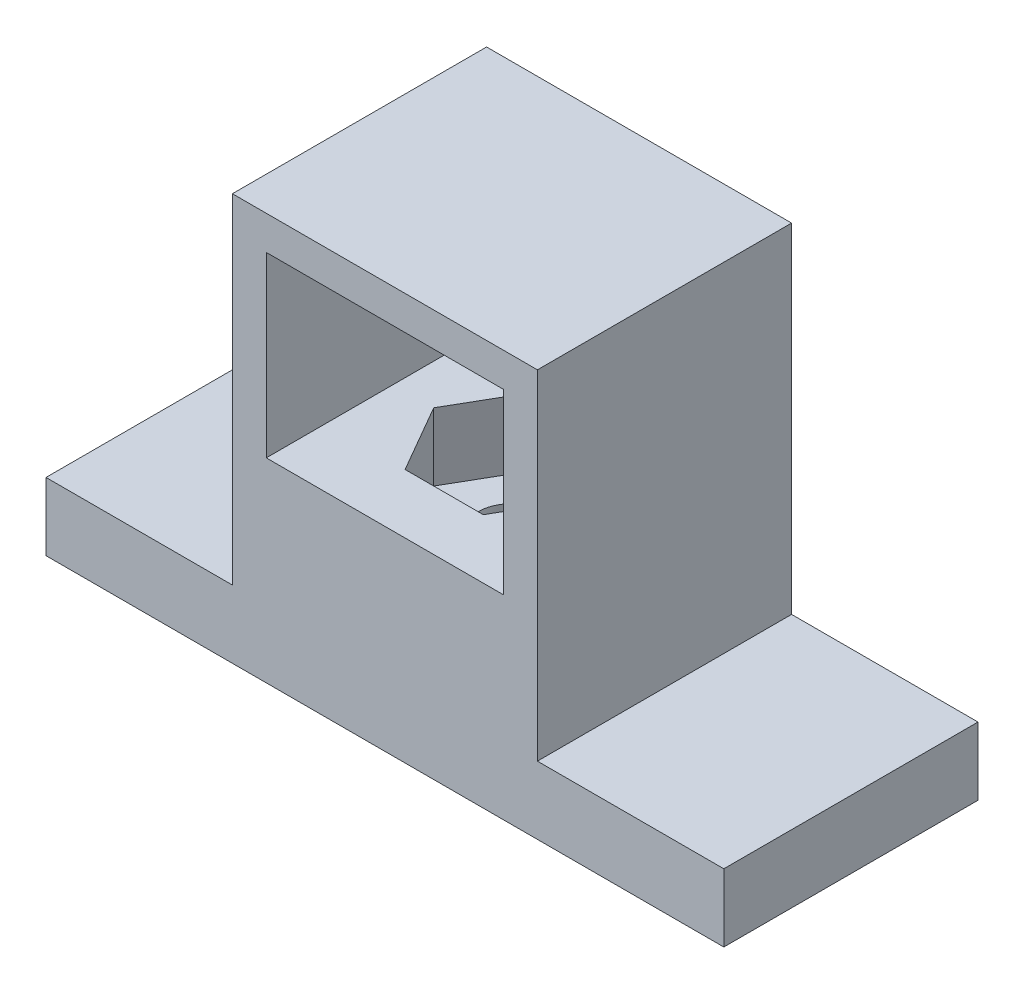
ISO-10303-21;
HEADER;
FILE_DESCRIPTION(('STEP AP214'),'2;1');
FILE_NAME('part.step','',(''),(''),'','','');
FILE_SCHEMA(('AUTOMOTIVE_DESIGN { 1 0 10303 214 1 1 1 1 }'));
ENDSEC;
DATA;
#1=APPLICATION_CONTEXT('core data for automotive mechanical design processes');
#2=APPLICATION_PROTOCOL_DEFINITION('international standard','automotive_design',2000,#1);
#3=PRODUCT_CONTEXT('',#1,'mechanical');
#4=PRODUCT('Part','Part','',(#3));
#5=PRODUCT_RELATED_PRODUCT_CATEGORY('part','',(#4));
#6=PRODUCT_DEFINITION_FORMATION('','',#4);
#7=PRODUCT_DEFINITION_CONTEXT('part definition',#1,'design');
#8=PRODUCT_DEFINITION('design','',#6,#7);
#9=PRODUCT_DEFINITION_SHAPE('','',#8);
#10=(LENGTH_UNIT() NAMED_UNIT(*) SI_UNIT(.MILLI.,.METRE.));
#11=(NAMED_UNIT(*) PLANE_ANGLE_UNIT() SI_UNIT($,.RADIAN.));
#12=(NAMED_UNIT(*) SI_UNIT($,.STERADIAN.) SOLID_ANGLE_UNIT());
#13=UNCERTAINTY_MEASURE_WITH_UNIT(LENGTH_MEASURE(1.E-05),#10,'distance_accuracy_value','');
#14=(GEOMETRIC_REPRESENTATION_CONTEXT(3) GLOBAL_UNCERTAINTY_ASSIGNED_CONTEXT((#13)) GLOBAL_UNIT_ASSIGNED_CONTEXT((#10,
#11,#12)) REPRESENTATION_CONTEXT('',''));
#15=CARTESIAN_POINT('',(0.,0.,0.));
#16=DIRECTION('',(0.,0.,1.));
#17=DIRECTION('',(1.,0.,0.));
#18=AXIS2_PLACEMENT_3D('',#15,#16,#17);
#19=CARTESIAN_POINT('',(0.,4.,0.));
#20=DIRECTION('',(0.,1.,0.));
#21=DIRECTION('',(0.,0.,1.));
#22=AXIS2_PLACEMENT_3D('',#19,#20,#21);
#23=PLANE('',#22);
#24=DIRECTION('',(0.,0.,-1.));
#25=VECTOR('',#24,1.);
#26=CARTESIAN_POINT('',(9.,4.,-7.5));
#27=LINE('',#26,#25);
#28=CARTESIAN_POINT('',(9.,4.,7.5));
#29=VERTEX_POINT('',#28);
#30=CARTESIAN_POINT('',(9.,4.,-7.5));
#31=VERTEX_POINT('',#30);
#32=EDGE_CURVE('E282',#29,#31,#27,.T.);
#33=ORIENTED_EDGE('',*,*,#32,.F.);
#34=DIRECTION('',(1.,0.,0.));
#35=VECTOR('',#34,1.);
#36=CARTESIAN_POINT('',(-20.,4.,7.5));
#37=LINE('',#36,#35);
#38=CARTESIAN_POINT('',(20.,4.,7.5));
#39=VERTEX_POINT('',#38);
#40=EDGE_CURVE('E332',#29,#39,#37,.T.);
#41=ORIENTED_EDGE('',*,*,#40,.T.);
#42=DIRECTION('',(0.,0.,-1.));
#43=VECTOR('',#42,1.);
#44=CARTESIAN_POINT('',(20.,4.,-7.5));
#45=LINE('',#44,#43);
#46=CARTESIAN_POINT('',(20.,4.,-7.5));
#47=VERTEX_POINT('',#46);
#48=EDGE_CURVE('E320',#39,#47,#45,.T.);
#49=ORIENTED_EDGE('',*,*,#48,.T.);
#50=DIRECTION('',(-1.,0.,0.));
#51=VECTOR('',#50,1.);
#52=CARTESIAN_POINT('',(-20.,4.,-7.5));
#53=LINE('',#52,#51);
#54=EDGE_CURVE('E326',#47,#31,#53,.T.);
#55=ORIENTED_EDGE('',*,*,#54,.T.);
#56=EDGE_LOOP('',(#33,#41,#49,#55));
#57=FACE_BOUND('',#56,.T.);
#58=ADVANCED_FACE('F39',(#57),#23,.T.);
#59=CARTESIAN_POINT('',(20.,4.,-7.5));
#60=DIRECTION('',(-1.,0.,0.));
#61=DIRECTION('',(0.,0.,1.));
#62=AXIS2_PLACEMENT_3D('',#59,#60,#61);
#63=PLANE('',#62);
#64=DIRECTION('',(0.,0.,-1.));
#65=VECTOR('',#64,1.);
#66=CARTESIAN_POINT('',(20.,0.,-7.5));
#67=LINE('',#66,#65);
#68=CARTESIAN_POINT('',(20.,0.,7.5));
#69=VERTEX_POINT('',#68);
#70=CARTESIAN_POINT('',(20.,0.,-7.5));
#71=VERTEX_POINT('',#70);
#72=EDGE_CURVE('E319',#69,#71,#67,.T.);
#73=ORIENTED_EDGE('',*,*,#72,.T.);
#74=DIRECTION('',(0.,-1.,0.));
#75=VECTOR('',#74,1.);
#76=CARTESIAN_POINT('',(20.,4.,-7.5));
#77=LINE('',#76,#75);
#78=EDGE_CURVE('E11',#47,#71,#77,.T.);
#79=ORIENTED_EDGE('',*,*,#78,.F.);
#80=ORIENTED_EDGE('',*,*,#48,.F.);
#81=DIRECTION('',(0.,-1.,0.));
#82=VECTOR('',#81,1.);
#83=CARTESIAN_POINT('',(20.,4.,7.5));
#84=LINE('',#83,#82);
#85=EDGE_CURVE('E336',#39,#69,#84,.T.);
#86=ORIENTED_EDGE('',*,*,#85,.T.);
#87=EDGE_LOOP('',(#73,#79,#80,#86));
#88=FACE_BOUND('',#87,.T.);
#89=ADVANCED_FACE('F41',(#88),#63,.F.);
#90=CARTESIAN_POINT('',(-20.,4.,-7.5));
#91=DIRECTION('',(0.,0.,1.));
#92=DIRECTION('',(1.,0.,0.));
#93=AXIS2_PLACEMENT_3D('',#90,#91,#92);
#94=PLANE('',#93);
#95=DIRECTION('',(1.,0.,0.));
#96=VECTOR('',#95,1.);
#97=CARTESIAN_POINT('',(-20.,11.5,-7.5));
#98=LINE('',#97,#96);
#99=CARTESIAN_POINT('',(-7.,11.5,-7.5));
#100=VERTEX_POINT('',#99);
#101=CARTESIAN_POINT('',(7.,11.5,-7.5));
#102=VERTEX_POINT('',#101);
#103=EDGE_CURVE('E274',#100,#102,#98,.T.);
#104=ORIENTED_EDGE('',*,*,#103,.T.);
#105=DIRECTION('',(0.,1.,0.));
#106=VECTOR('',#105,1.);
#107=CARTESIAN_POINT('',(7.,4.,-7.5));
#108=LINE('',#107,#106);
#109=CARTESIAN_POINT('',(7.,22.,-7.5));
#110=VERTEX_POINT('',#109);
#111=EDGE_CURVE('E278',#102,#110,#108,.T.);
#112=ORIENTED_EDGE('',*,*,#111,.T.);
#113=DIRECTION('',(-1.,0.,0.));
#114=VECTOR('',#113,1.);
#115=CARTESIAN_POINT('',(-20.,22.,-7.5));
#116=LINE('',#115,#114);
#117=CARTESIAN_POINT('',(-7.,22.,-7.5));
#118=VERTEX_POINT('',#117);
#119=EDGE_CURVE('E258',#110,#118,#116,.T.);
#120=ORIENTED_EDGE('',*,*,#119,.T.);
#121=DIRECTION('',(0.,-1.,0.));
#122=VECTOR('',#121,1.);
#123=CARTESIAN_POINT('',(-7.,4.,-7.5));
#124=LINE('',#123,#122);
#125=EDGE_CURVE('E270',#118,#100,#124,.T.);
#126=ORIENTED_EDGE('',*,*,#125,.T.);
#127=EDGE_LOOP('',(#104,#112,#120,#126));
#128=FACE_BOUND('',#127,.T.);
#129=DIRECTION('',(-1.,0.,0.));
#130=VECTOR('',#129,1.);
#131=CARTESIAN_POINT('',(-20.,0.,-7.5));
#132=LINE('',#131,#130);
#133=CARTESIAN_POINT('',(-20.,0.,-7.5));
#134=VERTEX_POINT('',#133);
#135=EDGE_CURVE('E340',#71,#134,#132,.T.);
#136=ORIENTED_EDGE('',*,*,#135,.T.);
#137=DIRECTION('',(0.,-1.,0.));
#138=VECTOR('',#137,1.);
#139=CARTESIAN_POINT('',(-20.,4.,-7.5));
#140=LINE('',#139,#138);
#141=CARTESIAN_POINT('',(-20.,4.,-7.5));
#142=VERTEX_POINT('',#141);
#143=EDGE_CURVE('E49',#142,#134,#140,.T.);
#144=ORIENTED_EDGE('',*,*,#143,.F.);
#145=CARTESIAN_POINT('',(-9.,4.,-7.5));
#146=VERTEX_POINT('',#145);
#147=EDGE_CURVE('E324',#146,#142,#53,.T.);
#148=ORIENTED_EDGE('',*,*,#147,.F.);
#149=DIRECTION('',(0.,-1.,0.));
#150=VECTOR('',#149,1.);
#151=CARTESIAN_POINT('',(-9.,24.,-7.5));
#152=LINE('',#151,#150);
#153=CARTESIAN_POINT('',(-9.,24.,-7.5));
#154=VERTEX_POINT('',#153);
#155=EDGE_CURVE('E311',#154,#146,#152,.T.);
#156=ORIENTED_EDGE('',*,*,#155,.F.);
#157=DIRECTION('',(-1.,0.,0.));
#158=VECTOR('',#157,1.);
#159=CARTESIAN_POINT('',(-9.,24.,-7.5));
#160=LINE('',#159,#158);
#161=CARTESIAN_POINT('',(9.,24.,-7.5));
#162=VERTEX_POINT('',#161);
#163=EDGE_CURVE('E287',#162,#154,#160,.T.);
#164=ORIENTED_EDGE('',*,*,#163,.F.);
#165=DIRECTION('',(0.,-1.,0.));
#166=VECTOR('',#165,1.);
#167=CARTESIAN_POINT('',(9.,24.,-7.5));
#168=LINE('',#167,#166);
#169=EDGE_CURVE('E315',#162,#31,#168,.T.);
#170=ORIENTED_EDGE('',*,*,#169,.T.);
#171=ORIENTED_EDGE('',*,*,#54,.F.);
#172=ORIENTED_EDGE('',*,*,#78,.T.);
#173=EDGE_LOOP('',(#136,#144,#148,#156,#164,#170,#171,#172));
#174=FACE_BOUND('',#173,.T.);
#175=ADVANCED_FACE('F384',(#128,#174),#94,.F.);
#176=CARTESIAN_POINT('',(-20.,4.,-7.5));
#177=DIRECTION('',(1.,0.,0.));
#178=DIRECTION('',(0.,0.,-1.));
#179=AXIS2_PLACEMENT_3D('',#176,#177,#178);
#180=PLANE('',#179);
#181=DIRECTION('',(0.,0.,1.));
#182=VECTOR('',#181,1.);
#183=CARTESIAN_POINT('',(-20.,0.,-7.5));
#184=LINE('',#183,#182);
#185=CARTESIAN_POINT('',(-20.,0.,7.5));
#186=VERTEX_POINT('',#185);
#187=EDGE_CURVE('E343',#134,#186,#184,.T.);
#188=ORIENTED_EDGE('',*,*,#187,.T.);
#189=DIRECTION('',(0.,-1.,0.));
#190=VECTOR('',#189,1.);
#191=CARTESIAN_POINT('',(-20.,4.,7.5));
#192=LINE('',#191,#190);
#193=CARTESIAN_POINT('',(-20.,4.,7.5));
#194=VERTEX_POINT('',#193);
#195=EDGE_CURVE('E351',#194,#186,#192,.T.);
#196=ORIENTED_EDGE('',*,*,#195,.F.);
#197=DIRECTION('',(0.,0.,1.));
#198=VECTOR('',#197,1.);
#199=CARTESIAN_POINT('',(-20.,4.,-7.5));
#200=LINE('',#199,#198);
#201=EDGE_CURVE('E329',#142,#194,#200,.T.);
#202=ORIENTED_EDGE('',*,*,#201,.F.);
#203=ORIENTED_EDGE('',*,*,#143,.T.);
#204=EDGE_LOOP('',(#188,#196,#202,#203));
#205=FACE_BOUND('',#204,.T.);
#206=ADVANCED_FACE('F361',(#205),#180,.F.);
#207=CARTESIAN_POINT('',(-20.,4.,7.5));
#208=DIRECTION('',(0.,0.,-1.));
#209=DIRECTION('',(-1.,0.,0.));
#210=AXIS2_PLACEMENT_3D('',#207,#208,#209);
#211=PLANE('',#210);
#212=DIRECTION('',(-1.,0.,0.));
#213=VECTOR('',#212,1.);
#214=CARTESIAN_POINT('',(-7.,22.,7.5));
#215=LINE('',#214,#213);
#216=CARTESIAN_POINT('',(7.,22.,7.5));
#217=VERTEX_POINT('',#216);
#218=CARTESIAN_POINT('',(-7.,22.,7.5));
#219=VERTEX_POINT('',#218);
#220=EDGE_CURVE('E243',#217,#219,#215,.T.);
#221=ORIENTED_EDGE('',*,*,#220,.F.);
#222=DIRECTION('',(0.,1.,0.));
#223=VECTOR('',#222,1.);
#224=CARTESIAN_POINT('',(7.,22.,7.5));
#225=LINE('',#224,#223);
#226=CARTESIAN_POINT('',(7.,11.5,7.5));
#227=VERTEX_POINT('',#226);
#228=EDGE_CURVE('E229',#227,#217,#225,.T.);
#229=ORIENTED_EDGE('',*,*,#228,.F.);
#230=DIRECTION('',(1.,0.,0.));
#231=VECTOR('',#230,1.);
#232=CARTESIAN_POINT('',(-7.,11.5,7.5));
#233=LINE('',#232,#231);
#234=CARTESIAN_POINT('',(-7.,11.5,7.5));
#235=VERTEX_POINT('',#234);
#236=EDGE_CURVE('E250',#235,#227,#233,.T.);
#237=ORIENTED_EDGE('',*,*,#236,.F.);
#238=DIRECTION('',(0.,-1.,0.));
#239=VECTOR('',#238,1.);
#240=CARTESIAN_POINT('',(-7.,22.,7.5));
#241=LINE('',#240,#239);
#242=EDGE_CURVE('E246',#219,#235,#241,.T.);
#243=ORIENTED_EDGE('',*,*,#242,.F.);
#244=EDGE_LOOP('',(#221,#229,#237,#243));
#245=FACE_BOUND('',#244,.T.);
#246=DIRECTION('',(1.,0.,0.));
#247=VECTOR('',#246,1.);
#248=CARTESIAN_POINT('',(-20.,0.,7.5));
#249=LINE('',#248,#247);
#250=EDGE_CURVE('E325',#186,#69,#249,.T.);
#251=ORIENTED_EDGE('',*,*,#250,.T.);
#252=ORIENTED_EDGE('',*,*,#85,.F.);
#253=ORIENTED_EDGE('',*,*,#40,.F.);
#254=DIRECTION('',(0.,-1.,0.));
#255=VECTOR('',#254,1.);
#256=CARTESIAN_POINT('',(9.,24.,7.5));
#257=LINE('',#256,#255);
#258=CARTESIAN_POINT('',(9.,24.,7.5));
#259=VERTEX_POINT('',#258);
#260=EDGE_CURVE('E297',#259,#29,#257,.T.);
#261=ORIENTED_EDGE('',*,*,#260,.F.);
#262=DIRECTION('',(1.,0.,0.));
#263=VECTOR('',#262,1.);
#264=CARTESIAN_POINT('',(-9.,24.,7.5));
#265=LINE('',#264,#263);
#266=CARTESIAN_POINT('',(-9.,24.,7.5));
#267=VERTEX_POINT('',#266);
#268=EDGE_CURVE('E294',#267,#259,#265,.T.);
#269=ORIENTED_EDGE('',*,*,#268,.F.);
#270=DIRECTION('',(0.,-1.,0.));
#271=VECTOR('',#270,1.);
#272=CARTESIAN_POINT('',(-9.,24.,7.5));
#273=LINE('',#272,#271);
#274=CARTESIAN_POINT('',(-9.,4.,7.5));
#275=VERTEX_POINT('',#274);
#276=EDGE_CURVE('E307',#267,#275,#273,.T.);
#277=ORIENTED_EDGE('',*,*,#276,.T.);
#278=EDGE_CURVE('E333',#194,#275,#37,.T.);
#279=ORIENTED_EDGE('',*,*,#278,.F.);
#280=ORIENTED_EDGE('',*,*,#195,.T.);
#281=EDGE_LOOP('',(#251,#252,#253,#261,#269,#277,#279,#280));
#282=FACE_BOUND('',#281,.T.);
#283=ADVANCED_FACE('F371',(#245,#282),#211,.F.);
#284=DIRECTION('',(0.,0.,1.));
#285=VECTOR('',#284,1.);
#286=CARTESIAN_POINT('',(-9.,4.,-7.5));
#287=LINE('',#286,#285);
#288=EDGE_CURVE('E288',#146,#275,#287,.T.);
#289=ORIENTED_EDGE('',*,*,#288,.F.);
#290=ORIENTED_EDGE('',*,*,#147,.T.);
#291=ORIENTED_EDGE('',*,*,#201,.T.);
#292=ORIENTED_EDGE('',*,*,#278,.T.);
#293=EDGE_LOOP('',(#289,#290,#291,#292));
#294=FACE_BOUND('',#293,.T.);
#295=ADVANCED_FACE('F382',(#294),#23,.T.);
#296=CARTESIAN_POINT('',(0.,0.,0.));
#297=DIRECTION('',(0.,1.,0.));
#298=DIRECTION('',(0.,0.,1.));
#299=AXIS2_PLACEMENT_3D('',#296,#297,#298);
#300=PLANE('',#299);
#301=CARTESIAN_POINT('',(0.,0.,0.));
#302=DIRECTION('',(0.,1.,0.));
#303=DIRECTION('',(0.,0.,1.));
#304=AXIS2_PLACEMENT_3D('',#301,#302,#303);
#305=CIRCLE('',#304,2.);
#306=CARTESIAN_POINT('',(0.,0.,2.));
#307=VERTEX_POINT('',#306);
#308=EDGE_CURVE('E43',#307,#307,#305,.T.);
#309=ORIENTED_EDGE('',*,*,#308,.T.);
#310=EDGE_LOOP('',(#309));
#311=FACE_BOUND('',#310,.T.);
#312=ORIENTED_EDGE('',*,*,#72,.F.);
#313=ORIENTED_EDGE('',*,*,#250,.F.);
#314=ORIENTED_EDGE('',*,*,#187,.F.);
#315=ORIENTED_EDGE('',*,*,#135,.F.);
#316=EDGE_LOOP('',(#312,#313,#314,#315));
#317=FACE_BOUND('',#316,.T.);
#318=ADVANCED_FACE('F368',(#311,#317),#300,.F.);
#319=CARTESIAN_POINT('',(9.,24.,-7.5));
#320=DIRECTION('',(-1.,0.,0.));
#321=DIRECTION('',(0.,0.,1.));
#322=AXIS2_PLACEMENT_3D('',#319,#320,#321);
#323=PLANE('',#322);
#324=ORIENTED_EDGE('',*,*,#32,.T.);
#325=ORIENTED_EDGE('',*,*,#169,.F.);
#326=DIRECTION('',(0.,0.,-1.));
#327=VECTOR('',#326,1.);
#328=CARTESIAN_POINT('',(9.,24.,-7.5));
#329=LINE('',#328,#327);
#330=EDGE_CURVE('E283',#259,#162,#329,.T.);
#331=ORIENTED_EDGE('',*,*,#330,.F.);
#332=ORIENTED_EDGE('',*,*,#260,.T.);
#333=EDGE_LOOP('',(#324,#325,#331,#332));
#334=FACE_BOUND('',#333,.T.);
#335=ADVANCED_FACE('F395',(#334),#323,.F.);
#336=CARTESIAN_POINT('',(-9.,24.,-7.5));
#337=DIRECTION('',(1.,0.,0.));
#338=DIRECTION('',(0.,0.,-1.));
#339=AXIS2_PLACEMENT_3D('',#336,#337,#338);
#340=PLANE('',#339);
#341=ORIENTED_EDGE('',*,*,#288,.T.);
#342=ORIENTED_EDGE('',*,*,#276,.F.);
#343=DIRECTION('',(0.,0.,1.));
#344=VECTOR('',#343,1.);
#345=CARTESIAN_POINT('',(-9.,24.,-7.5));
#346=LINE('',#345,#344);
#347=EDGE_CURVE('E291',#154,#267,#346,.T.);
#348=ORIENTED_EDGE('',*,*,#347,.F.);
#349=ORIENTED_EDGE('',*,*,#155,.T.);
#350=EDGE_LOOP('',(#341,#342,#348,#349));
#351=FACE_BOUND('',#350,.T.);
#352=ADVANCED_FACE('F387',(#351),#340,.F.);
#353=CARTESIAN_POINT('',(0.,24.,0.));
#354=DIRECTION('',(0.,1.,0.));
#355=DIRECTION('',(0.,0.,1.));
#356=AXIS2_PLACEMENT_3D('',#353,#354,#355);
#357=PLANE('',#356);
#358=ORIENTED_EDGE('',*,*,#330,.T.);
#359=ORIENTED_EDGE('',*,*,#163,.T.);
#360=ORIENTED_EDGE('',*,*,#347,.T.);
#361=ORIENTED_EDGE('',*,*,#268,.T.);
#362=EDGE_LOOP('',(#358,#359,#360,#361));
#363=FACE_BOUND('',#362,.T.);
#364=ADVANCED_FACE('F391',(#363),#357,.T.);
#365=CARTESIAN_POINT('',(7.,22.,-11.5));
#366=DIRECTION('',(1.,0.,0.));
#367=DIRECTION('',(0.,1.,0.));
#368=AXIS2_PLACEMENT_3D('',#365,#366,#367);
#369=PLANE('',#368);
#370=DIRECTION('',(0.,0.,1.));
#371=VECTOR('',#370,1.);
#372=CARTESIAN_POINT('',(7.,11.5,-11.5));
#373=LINE('',#372,#371);
#374=EDGE_CURVE('E255',#102,#227,#373,.T.);
#375=ORIENTED_EDGE('',*,*,#374,.T.);
#376=ORIENTED_EDGE('',*,*,#228,.T.);
#377=DIRECTION('',(0.,0.,1.));
#378=VECTOR('',#377,1.);
#379=CARTESIAN_POINT('',(7.,22.,-11.5));
#380=LINE('',#379,#378);
#381=EDGE_CURVE('E254',#110,#217,#380,.T.);
#382=ORIENTED_EDGE('',*,*,#381,.F.);
#383=ORIENTED_EDGE('',*,*,#111,.F.);
#384=EDGE_LOOP('',(#375,#376,#382,#383));
#385=FACE_BOUND('',#384,.T.);
#386=ADVANCED_FACE('F436',(#385),#369,.F.);
#387=CARTESIAN_POINT('',(-7.,11.5,-11.5));
#388=DIRECTION('',(0.,-1.,0.));
#389=DIRECTION('',(0.,0.,-1.));
#390=AXIS2_PLACEMENT_3D('',#387,#388,#389);
#391=PLANE('',#390);
#392=DIRECTION('',(-0.5,0.,0.866025403784438));
#393=VECTOR('',#392,1.);
#394=CARTESIAN_POINT('',(-2.3094010767585,11.5,-4.));
#395=LINE('',#394,#393);
#396=CARTESIAN_POINT('',(-2.3094010767585,11.5,-4.));
#397=VERTEX_POINT('',#396);
#398=CARTESIAN_POINT('',(-4.61880215351701,11.5,0.));
#399=VERTEX_POINT('',#398);
#400=EDGE_CURVE('E212',#397,#399,#395,.T.);
#401=ORIENTED_EDGE('',*,*,#400,.F.);
#402=DIRECTION('',(-1.,0.,0.));
#403=VECTOR('',#402,1.);
#404=CARTESIAN_POINT('',(2.3094010767585,11.5,-4.));
#405=LINE('',#404,#403);
#406=CARTESIAN_POINT('',(2.3094010767585,11.5,-4.));
#407=VERTEX_POINT('',#406);
#408=EDGE_CURVE('E56',#407,#397,#405,.T.);
#409=ORIENTED_EDGE('',*,*,#408,.F.);
#410=DIRECTION('',(-0.5,0.,-0.866025403784439));
#411=VECTOR('',#410,1.);
#412=CARTESIAN_POINT('',(4.61880215351701,11.5,0.));
#413=LINE('',#412,#411);
#414=CARTESIAN_POINT('',(4.61880215351701,11.5,0.));
#415=VERTEX_POINT('',#414);
#416=EDGE_CURVE('E190',#415,#407,#413,.T.);
#417=ORIENTED_EDGE('',*,*,#416,.F.);
#418=DIRECTION('',(0.5,0.,-0.866025403784439));
#419=VECTOR('',#418,1.);
#420=CARTESIAN_POINT('',(2.3094010767585,11.5,4.));
#421=LINE('',#420,#419);
#422=CARTESIAN_POINT('',(2.3094010767585,11.5,4.));
#423=VERTEX_POINT('',#422);
#424=EDGE_CURVE('E194',#423,#415,#421,.T.);
#425=ORIENTED_EDGE('',*,*,#424,.F.);
#426=DIRECTION('',(1.,0.,0.));
#427=VECTOR('',#426,1.);
#428=CARTESIAN_POINT('',(-2.3094010767585,11.5,4.));
#429=LINE('',#428,#427);
#430=CARTESIAN_POINT('',(-2.3094010767585,11.5,4.));
#431=VERTEX_POINT('',#430);
#432=EDGE_CURVE('E219',#431,#423,#429,.T.);
#433=ORIENTED_EDGE('',*,*,#432,.F.);
#434=DIRECTION('',(0.5,0.,0.866025403784439));
#435=VECTOR('',#434,1.);
#436=CARTESIAN_POINT('',(-4.61880215351701,11.5,0.));
#437=LINE('',#436,#435);
#438=EDGE_CURVE('E215',#399,#431,#437,.T.);
#439=ORIENTED_EDGE('',*,*,#438,.F.);
#440=EDGE_LOOP('',(#401,#409,#417,#425,#433,#439));
#441=FACE_BOUND('',#440,.T.);
#442=DIRECTION('',(0.,0.,1.));
#443=VECTOR('',#442,1.);
#444=CARTESIAN_POINT('',(-7.,11.5,-11.5));
#445=LINE('',#444,#443);
#446=EDGE_CURVE('E259',#100,#235,#445,.T.);
#447=ORIENTED_EDGE('',*,*,#446,.T.);
#448=ORIENTED_EDGE('',*,*,#236,.T.);
#449=ORIENTED_EDGE('',*,*,#374,.F.);
#450=ORIENTED_EDGE('',*,*,#103,.F.);
#451=EDGE_LOOP('',(#447,#448,#449,#450));
#452=FACE_BOUND('',#451,.T.);
#453=ADVANCED_FACE('F428',(#441,#452),#391,.F.);
#454=CARTESIAN_POINT('',(-7.,22.,-11.5));
#455=DIRECTION('',(-1.,0.,0.));
#456=DIRECTION('',(0.,0.,1.));
#457=AXIS2_PLACEMENT_3D('',#454,#455,#456);
#458=PLANE('',#457);
#459=DIRECTION('',(0.,0.,1.));
#460=VECTOR('',#459,1.);
#461=CARTESIAN_POINT('',(-7.,22.,-11.5));
#462=LINE('',#461,#460);
#463=EDGE_CURVE('E64',#118,#219,#462,.T.);
#464=ORIENTED_EDGE('',*,*,#463,.T.);
#465=ORIENTED_EDGE('',*,*,#242,.T.);
#466=ORIENTED_EDGE('',*,*,#446,.F.);
#467=ORIENTED_EDGE('',*,*,#125,.F.);
#468=EDGE_LOOP('',(#464,#465,#466,#467));
#469=FACE_BOUND('',#468,.T.);
#470=ADVANCED_FACE('F430',(#469),#458,.F.);
#471=CARTESIAN_POINT('',(-7.,22.,-11.5));
#472=DIRECTION('',(0.,1.,0.));
#473=DIRECTION('',(0.,0.,1.));
#474=AXIS2_PLACEMENT_3D('',#471,#472,#473);
#475=PLANE('',#474);
#476=ORIENTED_EDGE('',*,*,#381,.T.);
#477=ORIENTED_EDGE('',*,*,#220,.T.);
#478=ORIENTED_EDGE('',*,*,#463,.F.);
#479=ORIENTED_EDGE('',*,*,#119,.F.);
#480=EDGE_LOOP('',(#476,#477,#478,#479));
#481=FACE_BOUND('',#480,.T.);
#482=ADVANCED_FACE('F437',(#481),#475,.F.);
#483=CARTESIAN_POINT('',(2.3094010767585,7.5,-4.));
#484=DIRECTION('',(0.,0.,-1.));
#485=DIRECTION('',(-1.,0.,0.));
#486=AXIS2_PLACEMENT_3D('',#483,#484,#485);
#487=PLANE('',#486);
#488=ORIENTED_EDGE('',*,*,#408,.T.);
#489=DIRECTION('',(0.,1.,0.));
#490=VECTOR('',#489,1.);
#491=CARTESIAN_POINT('',(-2.3094010767585,7.5,-4.));
#492=LINE('',#491,#490);
#493=CARTESIAN_POINT('',(-2.3094010767585,7.5,-4.));
#494=VERTEX_POINT('',#493);
#495=EDGE_CURVE('E164',#494,#397,#492,.T.);
#496=ORIENTED_EDGE('',*,*,#495,.F.);
#497=DIRECTION('',(-1.,0.,0.));
#498=VECTOR('',#497,1.);
#499=CARTESIAN_POINT('',(2.3094010767585,7.5,-4.));
#500=LINE('',#499,#498);
#501=CARTESIAN_POINT('',(2.3094010767585,7.5,-4.));
#502=VERTEX_POINT('',#501);
#503=EDGE_CURVE('E168',#502,#494,#500,.T.);
#504=ORIENTED_EDGE('',*,*,#503,.F.);
#505=DIRECTION('',(0.,1.,0.));
#506=VECTOR('',#505,1.);
#507=CARTESIAN_POINT('',(2.3094010767585,7.5,-4.));
#508=LINE('',#507,#506);
#509=EDGE_CURVE('E226',#502,#407,#508,.T.);
#510=ORIENTED_EDGE('',*,*,#509,.T.);
#511=EDGE_LOOP('',(#488,#496,#504,#510));
#512=FACE_BOUND('',#511,.T.);
#513=ADVANCED_FACE('F166',(#512),#487,.F.);
#514=CARTESIAN_POINT('',(4.61880215351701,7.5,0.));
#515=DIRECTION('',(0.866025403784439,0.,-0.5));
#516=DIRECTION('',(-0.5,0.,-0.866025403784439));
#517=AXIS2_PLACEMENT_3D('',#514,#515,#516);
#518=PLANE('',#517);
#519=ORIENTED_EDGE('',*,*,#416,.T.);
#520=ORIENTED_EDGE('',*,*,#509,.F.);
#521=DIRECTION('',(-0.5,0.,-0.866025403784439));
#522=VECTOR('',#521,1.);
#523=CARTESIAN_POINT('',(4.61880215351701,7.5,0.));
#524=LINE('',#523,#522);
#525=CARTESIAN_POINT('',(4.61880215351701,7.5,0.));
#526=VERTEX_POINT('',#525);
#527=EDGE_CURVE('E175',#526,#502,#524,.T.);
#528=ORIENTED_EDGE('',*,*,#527,.F.);
#529=DIRECTION('',(0.,1.,0.));
#530=VECTOR('',#529,1.);
#531=CARTESIAN_POINT('',(4.61880215351701,7.5,0.));
#532=LINE('',#531,#530);
#533=EDGE_CURVE('E230',#526,#415,#532,.T.);
#534=ORIENTED_EDGE('',*,*,#533,.T.);
#535=EDGE_LOOP('',(#519,#520,#528,#534));
#536=FACE_BOUND('',#535,.T.);
#537=ADVANCED_FACE('F444',(#536),#518,.F.);
#538=CARTESIAN_POINT('',(2.3094010767585,7.5,4.));
#539=DIRECTION('',(0.866025403784439,0.,0.5));
#540=DIRECTION('',(0.5,0.,-0.866025403784439));
#541=AXIS2_PLACEMENT_3D('',#538,#539,#540);
#542=PLANE('',#541);
#543=ORIENTED_EDGE('',*,*,#424,.T.);
#544=ORIENTED_EDGE('',*,*,#533,.F.);
#545=DIRECTION('',(0.5,0.,-0.866025403784439));
#546=VECTOR('',#545,1.);
#547=CARTESIAN_POINT('',(2.3094010767585,7.5,4.));
#548=LINE('',#547,#546);
#549=CARTESIAN_POINT('',(2.3094010767585,7.5,4.));
#550=VERTEX_POINT('',#549);
#551=EDGE_CURVE('E205',#550,#526,#548,.T.);
#552=ORIENTED_EDGE('',*,*,#551,.F.);
#553=DIRECTION('',(0.,1.,0.));
#554=VECTOR('',#553,1.);
#555=CARTESIAN_POINT('',(2.3094010767585,7.5,4.));
#556=LINE('',#555,#554);
#557=EDGE_CURVE('E233',#550,#423,#556,.T.);
#558=ORIENTED_EDGE('',*,*,#557,.T.);
#559=EDGE_LOOP('',(#543,#544,#552,#558));
#560=FACE_BOUND('',#559,.T.);
#561=ADVANCED_FACE('F489',(#560),#542,.F.);
#562=CARTESIAN_POINT('',(-2.3094010767585,7.5,4.));
#563=DIRECTION('',(0.,0.,1.));
#564=DIRECTION('',(1.,0.,0.));
#565=AXIS2_PLACEMENT_3D('',#562,#563,#564);
#566=PLANE('',#565);
#567=ORIENTED_EDGE('',*,*,#432,.T.);
#568=ORIENTED_EDGE('',*,*,#557,.F.);
#569=DIRECTION('',(1.,0.,0.));
#570=VECTOR('',#569,1.);
#571=CARTESIAN_POINT('',(-2.3094010767585,7.5,4.));
#572=LINE('',#571,#570);
#573=CARTESIAN_POINT('',(-2.3094010767585,7.5,4.));
#574=VERTEX_POINT('',#573);
#575=EDGE_CURVE('E201',#574,#550,#572,.T.);
#576=ORIENTED_EDGE('',*,*,#575,.F.);
#577=DIRECTION('',(0.,1.,0.));
#578=VECTOR('',#577,1.);
#579=CARTESIAN_POINT('',(-2.3094010767585,7.5,4.));
#580=LINE('',#579,#578);
#581=EDGE_CURVE('E236',#574,#431,#580,.T.);
#582=ORIENTED_EDGE('',*,*,#581,.T.);
#583=EDGE_LOOP('',(#567,#568,#576,#582));
#584=FACE_BOUND('',#583,.T.);
#585=ADVANCED_FACE('F498',(#584),#566,.F.);
#586=CARTESIAN_POINT('',(-4.61880215351701,7.5,0.));
#587=DIRECTION('',(-0.866025403784439,0.,0.5));
#588=DIRECTION('',(0.5,0.,0.866025403784439));
#589=AXIS2_PLACEMENT_3D('',#586,#587,#588);
#590=PLANE('',#589);
#591=ORIENTED_EDGE('',*,*,#438,.T.);
#592=ORIENTED_EDGE('',*,*,#581,.F.);
#593=DIRECTION('',(0.5,0.,0.866025403784439));
#594=VECTOR('',#593,1.);
#595=CARTESIAN_POINT('',(-4.61880215351701,7.5,0.));
#596=LINE('',#595,#594);
#597=CARTESIAN_POINT('',(-4.61880215351701,7.5,0.));
#598=VERTEX_POINT('',#597);
#599=EDGE_CURVE('E184',#598,#574,#596,.T.);
#600=ORIENTED_EDGE('',*,*,#599,.F.);
#601=DIRECTION('',(0.,1.,0.));
#602=VECTOR('',#601,1.);
#603=CARTESIAN_POINT('',(-4.61880215351701,7.5,0.));
#604=LINE('',#603,#602);
#605=EDGE_CURVE('E174',#598,#399,#604,.T.);
#606=ORIENTED_EDGE('',*,*,#605,.T.);
#607=EDGE_LOOP('',(#591,#592,#600,#606));
#608=FACE_BOUND('',#607,.T.);
#609=ADVANCED_FACE('F507',(#608),#590,.F.);
#610=CARTESIAN_POINT('',(-2.3094010767585,7.5,-4.));
#611=DIRECTION('',(-0.866025403784439,0.,-0.5));
#612=DIRECTION('',(-0.5,0.,0.866025403784438));
#613=AXIS2_PLACEMENT_3D('',#610,#611,#612);
#614=PLANE('',#613);
#615=ORIENTED_EDGE('',*,*,#400,.T.);
#616=ORIENTED_EDGE('',*,*,#605,.F.);
#617=DIRECTION('',(-0.5,0.,0.866025403784438));
#618=VECTOR('',#617,1.);
#619=CARTESIAN_POINT('',(-2.3094010767585,7.5,-4.));
#620=LINE('',#619,#618);
#621=EDGE_CURVE('E178',#494,#598,#620,.T.);
#622=ORIENTED_EDGE('',*,*,#621,.F.);
#623=ORIENTED_EDGE('',*,*,#495,.T.);
#624=EDGE_LOOP('',(#615,#616,#622,#623));
#625=FACE_BOUND('',#624,.T.);
#626=ADVANCED_FACE('F179',(#625),#614,.F.);
#627=CARTESIAN_POINT('',(0.,7.5,0.));
#628=DIRECTION('',(0.,1.,0.));
#629=DIRECTION('',(0.,0.,1.));
#630=AXIS2_PLACEMENT_3D('',#627,#628,#629);
#631=PLANE('',#630);
#632=CARTESIAN_POINT('',(0.,7.5,0.));
#633=DIRECTION('',(0.,1.,0.));
#634=DIRECTION('',(0.,0.,1.));
#635=AXIS2_PLACEMENT_3D('',#632,#633,#634);
#636=CIRCLE('',#635,2.);
#637=CARTESIAN_POINT('',(0.,7.5,2.));
#638=VERTEX_POINT('',#637);
#639=EDGE_CURVE('E197',#638,#638,#636,.T.);
#640=ORIENTED_EDGE('',*,*,#639,.F.);
#641=EDGE_LOOP('',(#640));
#642=FACE_BOUND('',#641,.T.);
#643=ORIENTED_EDGE('',*,*,#503,.T.);
#644=ORIENTED_EDGE('',*,*,#621,.T.);
#645=ORIENTED_EDGE('',*,*,#599,.T.);
#646=ORIENTED_EDGE('',*,*,#575,.T.);
#647=ORIENTED_EDGE('',*,*,#551,.T.);
#648=ORIENTED_EDGE('',*,*,#527,.T.);
#649=EDGE_LOOP('',(#643,#644,#645,#646,#647,#648));
#650=FACE_BOUND('',#649,.T.);
#651=ADVANCED_FACE('F186',(#642,#650),#631,.T.);
#652=CARTESIAN_POINT('',(0.,-56.5,0.));
#653=DIRECTION('',(0.,1.,0.));
#654=DIRECTION('',(0.,0.,1.));
#655=AXIS2_PLACEMENT_3D('',#652,#653,#654);
#656=CYLINDRICAL_SURFACE('',#655,2.);
#657=ORIENTED_EDGE('',*,*,#639,.T.);
#658=EDGE_LOOP('',(#657));
#659=FACE_BOUND('',#658,.T.);
#660=ORIENTED_EDGE('',*,*,#308,.F.);
#661=EDGE_LOOP('',(#660));
#662=FACE_BOUND('',#661,.T.);
#663=ADVANCED_FACE('F532',(#659,#662),#656,.F.);
#664=CLOSED_SHELL('',(#58,#89,#175,#206,#283,#295,#318,#335,#352,#364,#386,#453,#470,#482,#513,
#537,#561,#585,#609,#626,#651,#663));
#665=MANIFOLD_SOLID_BREP('B2',#664);
#666=ADVANCED_BREP_SHAPE_REPRESENTATION('',(#18,#665),#14);
#667=SHAPE_DEFINITION_REPRESENTATION(#9,#666);
ENDSEC;
END-ISO-10303-21;
